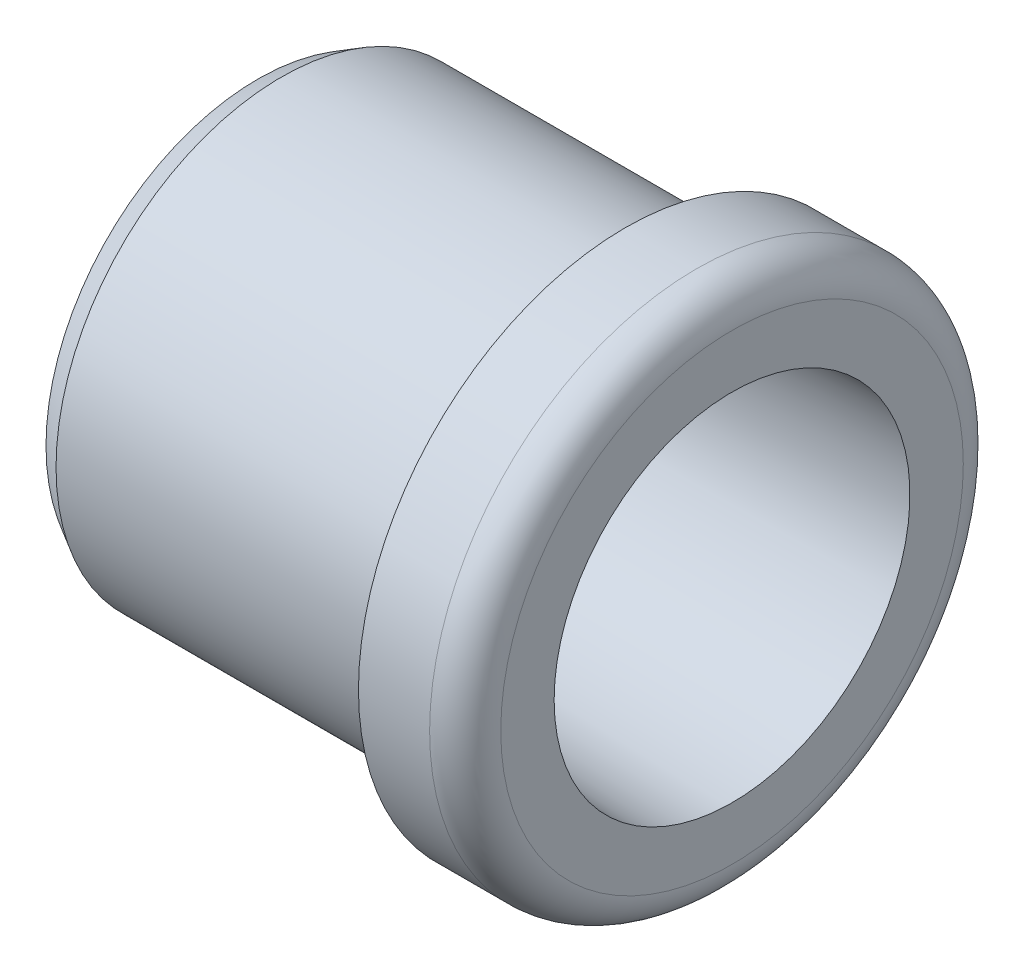
ISO-10303-21;
HEADER;
FILE_DESCRIPTION(('STEP AP214'),'2;1');
FILE_NAME('part.step','',(''),(''),'','','');
FILE_SCHEMA(('AUTOMOTIVE_DESIGN { 1 0 10303 214 1 1 1 1 }'));
ENDSEC;
DATA;
#1=APPLICATION_CONTEXT('core data for automotive mechanical design processes');
#2=APPLICATION_PROTOCOL_DEFINITION('international standard','automotive_design',2000,#1);
#3=PRODUCT_CONTEXT('',#1,'mechanical');
#4=PRODUCT('Part','Part','',(#3));
#5=PRODUCT_RELATED_PRODUCT_CATEGORY('part','',(#4));
#6=PRODUCT_DEFINITION_FORMATION('','',#4);
#7=PRODUCT_DEFINITION_CONTEXT('part definition',#1,'design');
#8=PRODUCT_DEFINITION('design','',#6,#7);
#9=PRODUCT_DEFINITION_SHAPE('','',#8);
#10=(LENGTH_UNIT() NAMED_UNIT(*) SI_UNIT(.MILLI.,.METRE.));
#11=(NAMED_UNIT(*) PLANE_ANGLE_UNIT() SI_UNIT($,.RADIAN.));
#12=(NAMED_UNIT(*) SI_UNIT($,.STERADIAN.) SOLID_ANGLE_UNIT());
#13=UNCERTAINTY_MEASURE_WITH_UNIT(LENGTH_MEASURE(1.E-05),#10,'distance_accuracy_value','');
#14=(GEOMETRIC_REPRESENTATION_CONTEXT(3) GLOBAL_UNCERTAINTY_ASSIGNED_CONTEXT((#13)) GLOBAL_UNIT_ASSIGNED_CONTEXT((#10,
#11,#12)) REPRESENTATION_CONTEXT('',''));
#15=CARTESIAN_POINT('',(0.,0.,0.));
#16=DIRECTION('',(0.,0.,1.));
#17=DIRECTION('',(1.,0.,0.));
#18=AXIS2_PLACEMENT_3D('',#15,#16,#17);
#19=CARTESIAN_POINT('',(12.8,0.,0.));
#20=DIRECTION('',(-1.,0.,0.));
#21=DIRECTION('',(0.,0.,1.));
#22=AXIS2_PLACEMENT_3D('',#19,#20,#21);
#23=TOROIDAL_SURFACE('',#22,13.2496674343854,0.799999999999999);
#24=CARTESIAN_POINT('',(12.772080402638,0.,0.));
#25=DIRECTION('',(-1.,0.,0.));
#26=DIRECTION('',(0.,0.,1.));
#27=AXIS2_PLACEMENT_3D('',#24,#25,#26);
#28=CIRCLE('',#27,14.0491800960007);
#29=CARTESIAN_POINT('',(12.772080402638,0.,14.0491800960007));
#30=VERTEX_POINT('',#29);
#31=EDGE_CURVE('E73',#30,#30,#28,.T.);
#32=ORIENTED_EDGE('',*,*,#31,.F.);
#33=EDGE_LOOP('',(#32));
#34=FACE_BOUND('',#33,.T.);
#35=CARTESIAN_POINT('',(12.,0.,0.));
#36=DIRECTION('',(-1.,0.,0.));
#37=DIRECTION('',(0.,0.,1.));
#38=AXIS2_PLACEMENT_3D('',#35,#36,#37);
#39=CIRCLE('',#38,13.2496674343854);
#40=CARTESIAN_POINT('',(12.,0.,13.2496674343854));
#41=VERTEX_POINT('',#40);
#42=EDGE_CURVE('E10',#41,#41,#39,.T.);
#43=ORIENTED_EDGE('',*,*,#42,.T.);
#44=EDGE_LOOP('',(#43));
#45=FACE_BOUND('',#44,.T.);
#46=ADVANCED_FACE('F36',(#34,#45),#23,.F.);
#47=CARTESIAN_POINT('',(12.,13.2496674343854,0.));
#48=DIRECTION('',(-1.,0.,0.));
#49=DIRECTION('',(0.,0.,1.));
#50=AXIS2_PLACEMENT_3D('',#47,#48,#49);
#51=PLANE('',#50);
#52=ORIENTED_EDGE('',*,*,#42,.F.);
#53=EDGE_LOOP('',(#52));
#54=FACE_BOUND('',#53,.T.);
#55=CARTESIAN_POINT('',(12.,0.,0.));
#56=DIRECTION('',(-1.,0.,0.));
#57=DIRECTION('',(0.,0.,1.));
#58=AXIS2_PLACEMENT_3D('',#55,#56,#57);
#59=CIRCLE('',#58,5.1);
#60=CARTESIAN_POINT('',(12.,0.,5.1));
#61=VERTEX_POINT('',#60);
#62=EDGE_CURVE('E42',#61,#61,#59,.T.);
#63=ORIENTED_EDGE('',*,*,#62,.T.);
#64=EDGE_LOOP('',(#63));
#65=FACE_BOUND('',#64,.T.);
#66=ADVANCED_FACE('F80',(#54,#65),#51,.F.);
#67=CARTESIAN_POINT('',(0.,0.,0.));
#68=DIRECTION('',(-1.,0.,0.));
#69=DIRECTION('',(0.,0.,1.));
#70=AXIS2_PLACEMENT_3D('',#67,#68,#69);
#71=CYLINDRICAL_SURFACE('',#70,5.1);
#72=ORIENTED_EDGE('',*,*,#62,.F.);
#73=EDGE_LOOP('',(#72));
#74=FACE_BOUND('',#73,.T.);
#75=CARTESIAN_POINT('',(0.,0.,0.));
#76=DIRECTION('',(-1.,0.,0.));
#77=DIRECTION('',(0.,0.,1.));
#78=AXIS2_PLACEMENT_3D('',#75,#76,#77);
#79=CIRCLE('',#78,5.1);
#80=CARTESIAN_POINT('',(0.,0.,5.1));
#81=VERTEX_POINT('',#80);
#82=EDGE_CURVE('E46',#81,#81,#79,.T.);
#83=ORIENTED_EDGE('',*,*,#82,.T.);
#84=EDGE_LOOP('',(#83));
#85=FACE_BOUND('',#84,.T.);
#86=ADVANCED_FACE('F84',(#74,#85),#71,.F.);
#87=CARTESIAN_POINT('',(0.,17.8452994616208,0.));
#88=DIRECTION('',(1.,0.,0.));
#89=DIRECTION('',(0.,0.,-1.));
#90=AXIS2_PLACEMENT_3D('',#87,#88,#89);
#91=PLANE('',#90);
#92=ORIENTED_EDGE('',*,*,#82,.F.);
#93=EDGE_LOOP('',(#92));
#94=FACE_BOUND('',#93,.T.);
#95=CARTESIAN_POINT('',(0.,0.,0.));
#96=DIRECTION('',(-1.,0.,0.));
#97=DIRECTION('',(0.,0.,1.));
#98=AXIS2_PLACEMENT_3D('',#95,#96,#97);
#99=CIRCLE('',#98,17.8452994616208);
#100=CARTESIAN_POINT('',(0.,0.,17.8452994616208));
#101=VERTEX_POINT('',#100);
#102=EDGE_CURVE('E50',#101,#101,#99,.T.);
#103=ORIENTED_EDGE('',*,*,#102,.T.);
#104=EDGE_LOOP('',(#103));
#105=FACE_BOUND('',#104,.T.);
#106=ADVANCED_FACE('F89',(#94,#105),#91,.F.);
#107=CARTESIAN_POINT('',(2.,0.,0.));
#108=DIRECTION('',(1.,0.,0.));
#109=DIRECTION('',(0.,0.,-1.));
#110=AXIS2_PLACEMENT_3D('',#107,#108,#109);
#111=CONICAL_SURFACE('',#110,19.,0.523598775598294);
#112=ORIENTED_EDGE('',*,*,#102,.F.);
#113=EDGE_LOOP('',(#112));
#114=FACE_BOUND('',#113,.T.);
#115=CARTESIAN_POINT('',(2.,0.,0.));
#116=DIRECTION('',(-1.,0.,0.));
#117=DIRECTION('',(0.,0.,1.));
#118=AXIS2_PLACEMENT_3D('',#115,#116,#117);
#119=CIRCLE('',#118,19.);
#120=CARTESIAN_POINT('',(2.,0.,19.));
#121=VERTEX_POINT('',#120);
#122=EDGE_CURVE('E55',#121,#121,#119,.T.);
#123=ORIENTED_EDGE('',*,*,#122,.T.);
#124=EDGE_LOOP('',(#123));
#125=FACE_BOUND('',#124,.T.);
#126=ADVANCED_FACE('F95',(#114,#125),#111,.T.);
#127=CARTESIAN_POINT('',(0.,0.,0.));
#128=DIRECTION('',(-1.,0.,0.));
#129=DIRECTION('',(0.,0.,1.));
#130=AXIS2_PLACEMENT_3D('',#127,#128,#129);
#131=CYLINDRICAL_SURFACE('',#130,19.);
#132=ORIENTED_EDGE('',*,*,#122,.F.);
#133=EDGE_LOOP('',(#132));
#134=FACE_BOUND('',#133,.T.);
#135=CARTESIAN_POINT('',(31.,0.,0.));
#136=DIRECTION('',(-1.,0.,0.));
#137=DIRECTION('',(0.,0.,1.));
#138=AXIS2_PLACEMENT_3D('',#135,#136,#137);
#139=CIRCLE('',#138,19.);
#140=CARTESIAN_POINT('',(31.,0.,19.));
#141=VERTEX_POINT('',#140);
#142=EDGE_CURVE('E58',#141,#141,#139,.T.);
#143=ORIENTED_EDGE('',*,*,#142,.T.);
#144=EDGE_LOOP('',(#143));
#145=FACE_BOUND('',#144,.T.);
#146=ADVANCED_FACE('F99',(#134,#145),#131,.T.);
#147=CARTESIAN_POINT('',(31.,22.5,0.));
#148=DIRECTION('',(1.,0.,0.));
#149=DIRECTION('',(0.,0.,-1.));
#150=AXIS2_PLACEMENT_3D('',#147,#148,#149);
#151=PLANE('',#150);
#152=ORIENTED_EDGE('',*,*,#142,.F.);
#153=EDGE_LOOP('',(#152));
#154=FACE_BOUND('',#153,.T.);
#155=CARTESIAN_POINT('',(31.,0.,0.));
#156=DIRECTION('',(-1.,0.,0.));
#157=DIRECTION('',(0.,0.,1.));
#158=AXIS2_PLACEMENT_3D('',#155,#156,#157);
#159=CIRCLE('',#158,22.5);
#160=CARTESIAN_POINT('',(31.,0.,22.5));
#161=VERTEX_POINT('',#160);
#162=EDGE_CURVE('E61',#161,#161,#159,.T.);
#163=ORIENTED_EDGE('',*,*,#162,.T.);
#164=EDGE_LOOP('',(#163));
#165=FACE_BOUND('',#164,.T.);
#166=ADVANCED_FACE('F103',(#154,#165),#151,.F.);
#167=CARTESIAN_POINT('',(0.,0.,0.));
#168=DIRECTION('',(-1.,0.,0.));
#169=DIRECTION('',(0.,0.,1.));
#170=AXIS2_PLACEMENT_3D('',#167,#168,#169);
#171=CYLINDRICAL_SURFACE('',#170,22.5);
#172=ORIENTED_EDGE('',*,*,#162,.F.);
#173=EDGE_LOOP('',(#172));
#174=FACE_BOUND('',#173,.T.);
#175=CARTESIAN_POINT('',(37.,0.,0.));
#176=DIRECTION('',(-1.,0.,0.));
#177=DIRECTION('',(0.,0.,1.));
#178=AXIS2_PLACEMENT_3D('',#175,#176,#177);
#179=CIRCLE('',#178,22.5);
#180=CARTESIAN_POINT('',(37.,0.,22.5));
#181=VERTEX_POINT('',#180);
#182=EDGE_CURVE('E64',#181,#181,#179,.T.);
#183=ORIENTED_EDGE('',*,*,#182,.T.);
#184=EDGE_LOOP('',(#183));
#185=FACE_BOUND('',#184,.T.);
#186=ADVANCED_FACE('F107',(#174,#185),#171,.T.);
#187=CARTESIAN_POINT('',(37.,0.,0.));
#188=DIRECTION('',(-1.,0.,0.));
#189=DIRECTION('',(0.,0.,1.));
#190=AXIS2_PLACEMENT_3D('',#187,#188,#189);
#191=TOROIDAL_SURFACE('',#190,19.5,3.);
#192=ORIENTED_EDGE('',*,*,#182,.F.);
#193=EDGE_LOOP('',(#192));
#194=FACE_BOUND('',#193,.T.);
#195=CARTESIAN_POINT('',(40.,0.,0.));
#196=DIRECTION('',(-1.,0.,0.));
#197=DIRECTION('',(0.,0.,1.));
#198=AXIS2_PLACEMENT_3D('',#195,#196,#197);
#199=CIRCLE('',#198,19.5);
#200=CARTESIAN_POINT('',(40.,0.,19.5));
#201=VERTEX_POINT('',#200);
#202=EDGE_CURVE('E67',#201,#201,#199,.T.);
#203=ORIENTED_EDGE('',*,*,#202,.T.);
#204=EDGE_LOOP('',(#203));
#205=FACE_BOUND('',#204,.T.);
#206=ADVANCED_FACE('F111',(#194,#205),#191,.T.);
#207=CARTESIAN_POINT('',(40.,15.,0.));
#208=DIRECTION('',(-1.,0.,0.));
#209=DIRECTION('',(0.,0.,1.));
#210=AXIS2_PLACEMENT_3D('',#207,#208,#209);
#211=PLANE('',#210);
#212=ORIENTED_EDGE('',*,*,#202,.F.);
#213=EDGE_LOOP('',(#212));
#214=FACE_BOUND('',#213,.T.);
#215=CARTESIAN_POINT('',(40.,0.,0.));
#216=DIRECTION('',(-1.,0.,0.));
#217=DIRECTION('',(0.,0.,1.));
#218=AXIS2_PLACEMENT_3D('',#215,#216,#217);
#219=CIRCLE('',#218,15.);
#220=CARTESIAN_POINT('',(40.,0.,15.));
#221=VERTEX_POINT('',#220);
#222=EDGE_CURVE('E70',#221,#221,#219,.T.);
#223=ORIENTED_EDGE('',*,*,#222,.T.);
#224=EDGE_LOOP('',(#223));
#225=FACE_BOUND('',#224,.T.);
#226=ADVANCED_FACE('F115',(#214,#225),#211,.F.);
#227=CARTESIAN_POINT('',(12.772080402638,0.,0.));
#228=DIRECTION('',(1.,0.,0.));
#229=DIRECTION('',(0.,0.,-1.));
#230=AXIS2_PLACEMENT_3D('',#227,#228,#229);
#231=CONICAL_SURFACE('',#230,14.0491800960007,0.0349065850398873);
#232=ORIENTED_EDGE('',*,*,#222,.F.);
#233=EDGE_LOOP('',(#232));
#234=FACE_BOUND('',#233,.T.);
#235=ORIENTED_EDGE('',*,*,#31,.T.);
#236=EDGE_LOOP('',(#235));
#237=FACE_BOUND('',#236,.T.);
#238=ADVANCED_FACE('F77',(#234,#237),#231,.F.);
#239=CLOSED_SHELL('',(#46,#66,#86,#106,#126,#146,#166,#186,#206,#226,#238));
#240=MANIFOLD_SOLID_BREP('B2',#239);
#241=ADVANCED_BREP_SHAPE_REPRESENTATION('',(#18,#240),#14);
#242=SHAPE_DEFINITION_REPRESENTATION(#9,#241);
ENDSEC;
END-ISO-10303-21;
